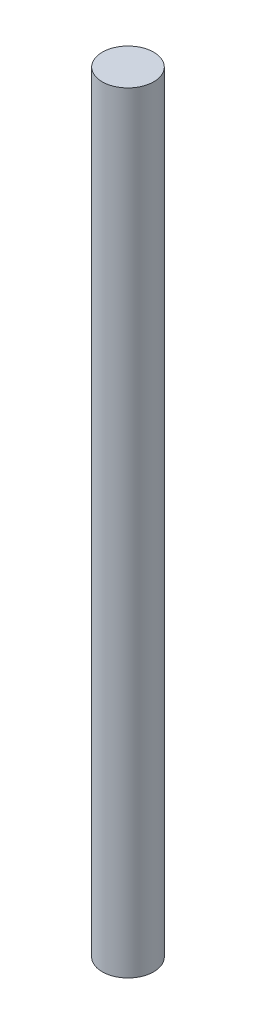
ISO-10303-21;
HEADER;
FILE_DESCRIPTION(('STEP AP214'),'2;1');
FILE_NAME('part.step','',(''),(''),'','','');
FILE_SCHEMA(('AUTOMOTIVE_DESIGN { 1 0 10303 214 1 1 1 1 }'));
ENDSEC;
DATA;
#1=APPLICATION_CONTEXT('core data for automotive mechanical design processes');
#2=APPLICATION_PROTOCOL_DEFINITION('international standard','automotive_design',2000,#1);
#3=PRODUCT_CONTEXT('',#1,'mechanical');
#4=PRODUCT('Part','Part','',(#3));
#5=PRODUCT_RELATED_PRODUCT_CATEGORY('part','',(#4));
#6=PRODUCT_DEFINITION_FORMATION('','',#4);
#7=PRODUCT_DEFINITION_CONTEXT('part definition',#1,'design');
#8=PRODUCT_DEFINITION('design','',#6,#7);
#9=PRODUCT_DEFINITION_SHAPE('','',#8);
#10=(LENGTH_UNIT() NAMED_UNIT(*) SI_UNIT(.MILLI.,.METRE.));
#11=(NAMED_UNIT(*) PLANE_ANGLE_UNIT() SI_UNIT($,.RADIAN.));
#12=(NAMED_UNIT(*) SI_UNIT($,.STERADIAN.) SOLID_ANGLE_UNIT());
#13=UNCERTAINTY_MEASURE_WITH_UNIT(LENGTH_MEASURE(1.E-05),#10,'distance_accuracy_value','');
#14=(GEOMETRIC_REPRESENTATION_CONTEXT(3) GLOBAL_UNCERTAINTY_ASSIGNED_CONTEXT((#13)) GLOBAL_UNIT_ASSIGNED_CONTEXT((#10,
#11,#12)) REPRESENTATION_CONTEXT('',''));
#15=CARTESIAN_POINT('',(0.,0.,0.));
#16=DIRECTION('',(0.,0.,1.));
#17=DIRECTION('',(1.,0.,0.));
#18=AXIS2_PLACEMENT_3D('',#15,#16,#17);
#19=CARTESIAN_POINT('',(0.,150.,0.));
#20=DIRECTION('',(0.,-1.,0.));
#21=DIRECTION('',(0.,0.,-1.));
#22=AXIS2_PLACEMENT_3D('',#19,#20,#21);
#23=CYLINDRICAL_SURFACE('',#22,5.);
#24=CARTESIAN_POINT('',(0.,150.,0.));
#25=DIRECTION('',(0.,1.,0.));
#26=DIRECTION('',(0.,0.,1.));
#27=AXIS2_PLACEMENT_3D('',#24,#25,#26);
#28=CIRCLE('',#27,5.);
#29=CARTESIAN_POINT('',(0.,150.,5.));
#30=VERTEX_POINT('',#29);
#31=EDGE_CURVE('E10',#30,#30,#28,.T.);
#32=ORIENTED_EDGE('',*,*,#31,.F.);
#33=EDGE_LOOP('',(#32));
#34=FACE_BOUND('',#33,.T.);
#35=CARTESIAN_POINT('',(0.,0.,0.));
#36=DIRECTION('',(0.,1.,0.));
#37=DIRECTION('',(0.,0.,1.));
#38=AXIS2_PLACEMENT_3D('',#35,#36,#37);
#39=CIRCLE('',#38,5.);
#40=CARTESIAN_POINT('',(0.,0.,5.));
#41=VERTEX_POINT('',#40);
#42=EDGE_CURVE('E36',#41,#41,#39,.T.);
#43=ORIENTED_EDGE('',*,*,#42,.T.);
#44=EDGE_LOOP('',(#43));
#45=FACE_BOUND('',#44,.T.);
#46=ADVANCED_FACE('F33',(#34,#45),#23,.T.);
#47=CARTESIAN_POINT('',(0.,150.,0.));
#48=DIRECTION('',(0.,1.,0.));
#49=DIRECTION('',(0.,0.,1.));
#50=AXIS2_PLACEMENT_3D('',#47,#48,#49);
#51=PLANE('',#50);
#52=ORIENTED_EDGE('',*,*,#31,.T.);
#53=EDGE_LOOP('',(#52));
#54=FACE_BOUND('',#53,.T.);
#55=ADVANCED_FACE('F48',(#54),#51,.T.);
#56=CARTESIAN_POINT('',(0.,0.,0.));
#57=DIRECTION('',(0.,1.,0.));
#58=DIRECTION('',(0.,0.,1.));
#59=AXIS2_PLACEMENT_3D('',#56,#57,#58);
#60=PLANE('',#59);
#61=ORIENTED_EDGE('',*,*,#42,.F.);
#62=EDGE_LOOP('',(#61));
#63=FACE_BOUND('',#62,.T.);
#64=ADVANCED_FACE('F46',(#63),#60,.F.);
#65=CLOSED_SHELL('',(#46,#55,#64));
#66=MANIFOLD_SOLID_BREP('B2',#65);
#67=ADVANCED_BREP_SHAPE_REPRESENTATION('',(#18,#66),#14);
#68=SHAPE_DEFINITION_REPRESENTATION(#9,#67);
ENDSEC;
END-ISO-10303-21;
